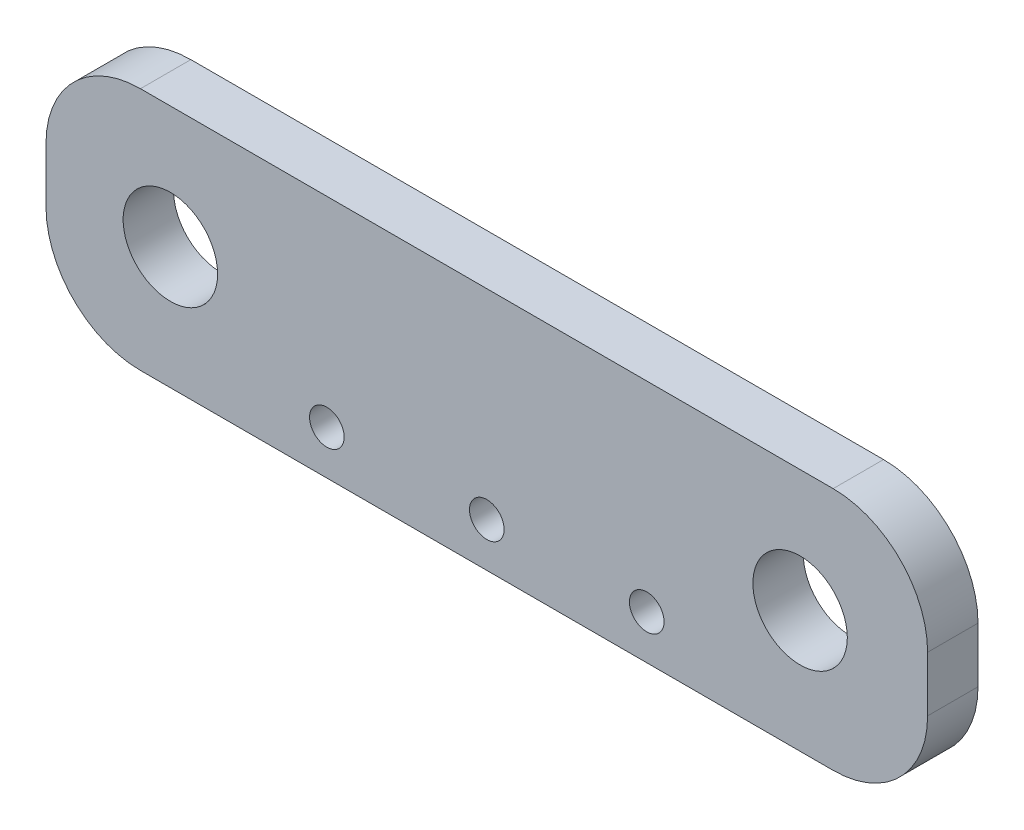
ISO-10303-21;
HEADER;
FILE_DESCRIPTION(('STEP AP214'),'2;1');
FILE_NAME('part.step','',(''),(''),'','','');
FILE_SCHEMA(('AUTOMOTIVE_DESIGN { 1 0 10303 214 1 1 1 1 }'));
ENDSEC;
DATA;
#1=APPLICATION_CONTEXT('core data for automotive mechanical design processes');
#2=APPLICATION_PROTOCOL_DEFINITION('international standard','automotive_design',2000,#1);
#3=PRODUCT_CONTEXT('',#1,'mechanical');
#4=PRODUCT('Part','Part','',(#3));
#5=PRODUCT_RELATED_PRODUCT_CATEGORY('part','',(#4));
#6=PRODUCT_DEFINITION_FORMATION('','',#4);
#7=PRODUCT_DEFINITION_CONTEXT('part definition',#1,'design');
#8=PRODUCT_DEFINITION('design','',#6,#7);
#9=PRODUCT_DEFINITION_SHAPE('','',#8);
#10=(LENGTH_UNIT() NAMED_UNIT(*) SI_UNIT(.MILLI.,.METRE.));
#11=(NAMED_UNIT(*) PLANE_ANGLE_UNIT() SI_UNIT($,.RADIAN.));
#12=(NAMED_UNIT(*) SI_UNIT($,.STERADIAN.) SOLID_ANGLE_UNIT());
#13=UNCERTAINTY_MEASURE_WITH_UNIT(LENGTH_MEASURE(1.E-05),#10,'distance_accuracy_value','');
#14=(GEOMETRIC_REPRESENTATION_CONTEXT(3) GLOBAL_UNCERTAINTY_ASSIGNED_CONTEXT((#13)) GLOBAL_UNIT_ASSIGNED_CONTEXT((#10,
#11,#12)) REPRESENTATION_CONTEXT('',''));
#15=CARTESIAN_POINT('',(0.,0.,0.));
#16=DIRECTION('',(0.,0.,1.));
#17=DIRECTION('',(1.,0.,0.));
#18=AXIS2_PLACEMENT_3D('',#15,#16,#17);
#19=CARTESIAN_POINT('',(14.,-3.875,1.6));
#20=DIRECTION('',(-1.,0.,0.));
#21=DIRECTION('',(0.,0.,1.));
#22=AXIS2_PLACEMENT_3D('',#19,#20,#21);
#23=PLANE('',#22);
#24=DIRECTION('',(0.,1.,0.));
#25=VECTOR('',#24,1.);
#26=CARTESIAN_POINT('',(14.,-3.875,0.));
#27=LINE('',#26,#25);
#28=CARTESIAN_POINT('',(14.,-0.875,0.));
#29=VERTEX_POINT('',#28);
#30=CARTESIAN_POINT('',(14.,0.875,0.));
#31=VERTEX_POINT('',#30);
#32=EDGE_CURVE('E129',#29,#31,#27,.T.);
#33=ORIENTED_EDGE('',*,*,#32,.T.);
#34=DIRECTION('',(0.,0.,-1.));
#35=VECTOR('',#34,1.);
#36=CARTESIAN_POINT('',(14.,0.875,1.6));
#37=LINE('',#36,#35);
#38=CARTESIAN_POINT('',(14.,0.875,1.6));
#39=VERTEX_POINT('',#38);
#40=EDGE_CURVE('E106',#31,#39,#37,.F.);
#41=ORIENTED_EDGE('',*,*,#40,.T.);
#42=DIRECTION('',(0.,1.,0.));
#43=VECTOR('',#42,1.);
#44=CARTESIAN_POINT('',(14.,-3.875,1.6));
#45=LINE('',#44,#43);
#46=CARTESIAN_POINT('',(14.,-0.875,1.6));
#47=VERTEX_POINT('',#46);
#48=EDGE_CURVE('E139',#47,#39,#45,.T.);
#49=ORIENTED_EDGE('',*,*,#48,.F.);
#50=DIRECTION('',(0.,0.,-1.));
#51=VECTOR('',#50,1.);
#52=CARTESIAN_POINT('',(14.,-0.875,1.6));
#53=LINE('',#52,#51);
#54=EDGE_CURVE('E111',#47,#29,#53,.T.);
#55=ORIENTED_EDGE('',*,*,#54,.T.);
#56=EDGE_LOOP('',(#33,#41,#49,#55));
#57=FACE_BOUND('',#56,.T.);
#58=ADVANCED_FACE('F34',(#57),#23,.F.);
#59=CARTESIAN_POINT('',(-14.,3.875,1.6));
#60=DIRECTION('',(0.,-1.,0.));
#61=DIRECTION('',(0.,0.,-1.));
#62=AXIS2_PLACEMENT_3D('',#59,#60,#61);
#63=PLANE('',#62);
#64=DIRECTION('',(-1.,0.,0.));
#65=VECTOR('',#64,1.);
#66=CARTESIAN_POINT('',(-14.,3.875,1.6));
#67=LINE('',#66,#65);
#68=CARTESIAN_POINT('',(11.,3.875,1.6));
#69=VERTEX_POINT('',#68);
#70=CARTESIAN_POINT('',(-11.,3.875,1.6));
#71=VERTEX_POINT('',#70);
#72=EDGE_CURVE('E121',#69,#71,#67,.T.);
#73=ORIENTED_EDGE('',*,*,#72,.F.);
#74=DIRECTION('',(0.,0.,-1.));
#75=VECTOR('',#74,1.);
#76=CARTESIAN_POINT('',(11.,3.875,1.6));
#77=LINE('',#76,#75);
#78=CARTESIAN_POINT('',(11.,3.875,0.));
#79=VERTEX_POINT('',#78);
#80=EDGE_CURVE('E105',#69,#79,#77,.T.);
#81=ORIENTED_EDGE('',*,*,#80,.T.);
#82=DIRECTION('',(-1.,0.,0.));
#83=VECTOR('',#82,1.);
#84=CARTESIAN_POINT('',(-14.,3.875,0.));
#85=LINE('',#84,#83);
#86=CARTESIAN_POINT('',(-11.,3.875,0.));
#87=VERTEX_POINT('',#86);
#88=EDGE_CURVE('E118',#79,#87,#85,.T.);
#89=ORIENTED_EDGE('',*,*,#88,.T.);
#90=DIRECTION('',(0.,0.,-1.));
#91=VECTOR('',#90,1.);
#92=CARTESIAN_POINT('',(-11.,3.875,1.6));
#93=LINE('',#92,#91);
#94=EDGE_CURVE('E123',#87,#71,#93,.F.);
#95=ORIENTED_EDGE('',*,*,#94,.T.);
#96=EDGE_LOOP('',(#73,#81,#89,#95));
#97=FACE_BOUND('',#96,.T.);
#98=ADVANCED_FACE('F117',(#97),#63,.F.);
#99=CARTESIAN_POINT('',(-14.,-3.875,1.6));
#100=DIRECTION('',(1.,0.,0.));
#101=DIRECTION('',(0.,0.,-1.));
#102=AXIS2_PLACEMENT_3D('',#99,#100,#101);
#103=PLANE('',#102);
#104=DIRECTION('',(0.,-1.,0.));
#105=VECTOR('',#104,1.);
#106=CARTESIAN_POINT('',(-14.,-3.875,1.6));
#107=LINE('',#106,#105);
#108=CARTESIAN_POINT('',(-14.,0.875,1.6));
#109=VERTEX_POINT('',#108);
#110=CARTESIAN_POINT('',(-14.,-0.875,1.6));
#111=VERTEX_POINT('',#110);
#112=EDGE_CURVE('E162',#109,#111,#107,.T.);
#113=ORIENTED_EDGE('',*,*,#112,.F.);
#114=DIRECTION('',(0.,0.,-1.));
#115=VECTOR('',#114,1.);
#116=CARTESIAN_POINT('',(-14.,0.875,1.6));
#117=LINE('',#116,#115);
#118=CARTESIAN_POINT('',(-14.,0.875,0.));
#119=VERTEX_POINT('',#118);
#120=EDGE_CURVE('E11',#109,#119,#117,.T.);
#121=ORIENTED_EDGE('',*,*,#120,.T.);
#122=DIRECTION('',(0.,-1.,0.));
#123=VECTOR('',#122,1.);
#124=CARTESIAN_POINT('',(-14.,-3.875,0.));
#125=LINE('',#124,#123);
#126=CARTESIAN_POINT('',(-14.,-0.875,0.));
#127=VERTEX_POINT('',#126);
#128=EDGE_CURVE('E128',#119,#127,#125,.T.);
#129=ORIENTED_EDGE('',*,*,#128,.T.);
#130=DIRECTION('',(0.,0.,-1.));
#131=VECTOR('',#130,1.);
#132=CARTESIAN_POINT('',(-14.,-0.875,1.6));
#133=LINE('',#132,#131);
#134=EDGE_CURVE('E42',#127,#111,#133,.F.);
#135=ORIENTED_EDGE('',*,*,#134,.T.);
#136=EDGE_LOOP('',(#113,#121,#129,#135));
#137=FACE_BOUND('',#136,.T.);
#138=ADVANCED_FACE('F161',(#137),#103,.F.);
#139=CARTESIAN_POINT('',(-14.,-3.875,1.6));
#140=DIRECTION('',(0.,1.,0.));
#141=DIRECTION('',(0.,0.,1.));
#142=AXIS2_PLACEMENT_3D('',#139,#140,#141);
#143=PLANE('',#142);
#144=DIRECTION('',(1.,0.,0.));
#145=VECTOR('',#144,1.);
#146=CARTESIAN_POINT('',(-14.,-3.875,0.));
#147=LINE('',#146,#145);
#148=CARTESIAN_POINT('',(-11.,-3.875,0.));
#149=VERTEX_POINT('',#148);
#150=CARTESIAN_POINT('',(11.,-3.875,0.));
#151=VERTEX_POINT('',#150);
#152=EDGE_CURVE('E132',#149,#151,#147,.T.);
#153=ORIENTED_EDGE('',*,*,#152,.T.);
#154=DIRECTION('',(0.,0.,-1.));
#155=VECTOR('',#154,1.);
#156=CARTESIAN_POINT('',(11.,-3.875,1.6));
#157=LINE('',#156,#155);
#158=CARTESIAN_POINT('',(11.,-3.875,1.6));
#159=VERTEX_POINT('',#158);
#160=EDGE_CURVE('E49',#151,#159,#157,.F.);
#161=ORIENTED_EDGE('',*,*,#160,.T.);
#162=DIRECTION('',(1.,0.,0.));
#163=VECTOR('',#162,1.);
#164=CARTESIAN_POINT('',(-14.,-3.875,1.6));
#165=LINE('',#164,#163);
#166=CARTESIAN_POINT('',(-11.,-3.875,1.6));
#167=VERTEX_POINT('',#166);
#168=EDGE_CURVE('E140',#167,#159,#165,.T.);
#169=ORIENTED_EDGE('',*,*,#168,.F.);
#170=DIRECTION('',(0.,0.,-1.));
#171=VECTOR('',#170,1.);
#172=CARTESIAN_POINT('',(-11.,-3.875,1.6));
#173=LINE('',#172,#171);
#174=EDGE_CURVE('E155',#167,#149,#173,.T.);
#175=ORIENTED_EDGE('',*,*,#174,.T.);
#176=EDGE_LOOP('',(#153,#161,#169,#175));
#177=FACE_BOUND('',#176,.T.);
#178=ADVANCED_FACE('F171',(#177),#143,.F.);
#179=CARTESIAN_POINT('',(0.,0.,1.6));
#180=DIRECTION('',(0.,0.,-1.));
#181=DIRECTION('',(-1.,0.,0.));
#182=AXIS2_PLACEMENT_3D('',#179,#180,#181);
#183=PLANE('',#182);
#184=CARTESIAN_POINT('',(5.08,-2.475,1.6));
#185=DIRECTION('',(0.,0.,1.));
#186=DIRECTION('',(1.,0.,0.));
#187=AXIS2_PLACEMENT_3D('',#184,#185,#186);
#188=CIRCLE('',#187,0.55);
#189=CARTESIAN_POINT('',(5.63,-2.475,1.6));
#190=VERTEX_POINT('',#189);
#191=EDGE_CURVE('E205',#190,#190,#188,.T.);
#192=ORIENTED_EDGE('',*,*,#191,.F.);
#193=EDGE_LOOP('',(#192));
#194=FACE_BOUND('',#193,.T.);
#195=CARTESIAN_POINT('',(-5.08,-2.475,1.6));
#196=DIRECTION('',(0.,0.,1.));
#197=DIRECTION('',(1.,0.,0.));
#198=AXIS2_PLACEMENT_3D('',#195,#196,#197);
#199=CIRCLE('',#198,0.55);
#200=CARTESIAN_POINT('',(-4.53,-2.475,1.6));
#201=VERTEX_POINT('',#200);
#202=EDGE_CURVE('E199',#201,#201,#199,.T.);
#203=ORIENTED_EDGE('',*,*,#202,.F.);
#204=EDGE_LOOP('',(#203));
#205=FACE_BOUND('',#204,.T.);
#206=CARTESIAN_POINT('',(0.,-2.475,1.6));
#207=DIRECTION('',(0.,0.,1.));
#208=DIRECTION('',(1.,0.,0.));
#209=AXIS2_PLACEMENT_3D('',#206,#207,#208);
#210=CIRCLE('',#209,0.55);
#211=CARTESIAN_POINT('',(0.55,-2.475,1.6));
#212=VERTEX_POINT('',#211);
#213=EDGE_CURVE('E193',#212,#212,#210,.T.);
#214=ORIENTED_EDGE('',*,*,#213,.F.);
#215=EDGE_LOOP('',(#214));
#216=FACE_BOUND('',#215,.T.);
#217=CARTESIAN_POINT('',(9.9499999999999,0.,1.6));
#218=DIRECTION('',(0.,0.,1.));
#219=DIRECTION('',(1.,0.,0.));
#220=AXIS2_PLACEMENT_3D('',#217,#218,#219);
#221=CIRCLE('',#220,1.5);
#222=CARTESIAN_POINT('',(11.4499999999999,0.,1.6));
#223=VERTEX_POINT('',#222);
#224=EDGE_CURVE('E187',#223,#223,#221,.T.);
#225=ORIENTED_EDGE('',*,*,#224,.F.);
#226=EDGE_LOOP('',(#225));
#227=FACE_BOUND('',#226,.T.);
#228=CARTESIAN_POINT('',(-10.05,0.,1.6));
#229=DIRECTION('',(0.,0.,1.));
#230=DIRECTION('',(1.,0.,0.));
#231=AXIS2_PLACEMENT_3D('',#228,#229,#230);
#232=CIRCLE('',#231,1.5);
#233=CARTESIAN_POINT('',(-8.55,0.,1.6));
#234=VERTEX_POINT('',#233);
#235=EDGE_CURVE('E181',#234,#234,#232,.T.);
#236=ORIENTED_EDGE('',*,*,#235,.F.);
#237=EDGE_LOOP('',(#236));
#238=FACE_BOUND('',#237,.T.);
#239=ORIENTED_EDGE('',*,*,#48,.T.);
#240=CARTESIAN_POINT('',(11.,0.875,1.6));
#241=DIRECTION('',(0.,0.,-1.));
#242=DIRECTION('',(-1.,0.,0.));
#243=AXIS2_PLACEMENT_3D('',#240,#241,#242);
#244=CIRCLE('',#243,3.);
#245=EDGE_CURVE('E153',#39,#69,#244,.F.);
#246=ORIENTED_EDGE('',*,*,#245,.T.);
#247=ORIENTED_EDGE('',*,*,#72,.T.);
#248=CARTESIAN_POINT('',(-11.,0.875,1.6));
#249=DIRECTION('',(0.,0.,-1.));
#250=DIRECTION('',(-1.,0.,0.));
#251=AXIS2_PLACEMENT_3D('',#248,#249,#250);
#252=CIRCLE('',#251,3.);
#253=EDGE_CURVE('E149',#71,#109,#252,.F.);
#254=ORIENTED_EDGE('',*,*,#253,.T.);
#255=ORIENTED_EDGE('',*,*,#112,.T.);
#256=CARTESIAN_POINT('',(-11.,-0.875,1.6));
#257=DIRECTION('',(0.,0.,-1.));
#258=DIRECTION('',(-1.,0.,0.));
#259=AXIS2_PLACEMENT_3D('',#256,#257,#258);
#260=CIRCLE('',#259,3.);
#261=EDGE_CURVE('E56',#111,#167,#260,.F.);
#262=ORIENTED_EDGE('',*,*,#261,.T.);
#263=ORIENTED_EDGE('',*,*,#168,.T.);
#264=CARTESIAN_POINT('',(11.,-0.875,1.6));
#265=DIRECTION('',(0.,0.,-1.));
#266=DIRECTION('',(-1.,0.,0.));
#267=AXIS2_PLACEMENT_3D('',#264,#265,#266);
#268=CIRCLE('',#267,3.);
#269=EDGE_CURVE('E151',#159,#47,#268,.F.);
#270=ORIENTED_EDGE('',*,*,#269,.T.);
#271=EDGE_LOOP('',(#239,#246,#247,#254,#255,#262,#263,#270));
#272=FACE_BOUND('',#271,.T.);
#273=ADVANCED_FACE('F166',(#194,#205,#216,#227,#238,#272),#183,.F.);
#274=CARTESIAN_POINT('',(0.,0.,0.));
#275=DIRECTION('',(0.,0.,-1.));
#276=DIRECTION('',(-1.,0.,0.));
#277=AXIS2_PLACEMENT_3D('',#274,#275,#276);
#278=PLANE('',#277);
#279=CARTESIAN_POINT('',(5.08,-2.475,0.));
#280=DIRECTION('',(0.,0.,1.));
#281=DIRECTION('',(1.,0.,0.));
#282=AXIS2_PLACEMENT_3D('',#279,#280,#281);
#283=CIRCLE('',#282,0.55);
#284=CARTESIAN_POINT('',(5.63,-2.475,0.));
#285=VERTEX_POINT('',#284);
#286=EDGE_CURVE('E202',#285,#285,#283,.T.);
#287=ORIENTED_EDGE('',*,*,#286,.T.);
#288=EDGE_LOOP('',(#287));
#289=FACE_BOUND('',#288,.T.);
#290=CARTESIAN_POINT('',(-5.08,-2.475,0.));
#291=DIRECTION('',(0.,0.,1.));
#292=DIRECTION('',(1.,0.,0.));
#293=AXIS2_PLACEMENT_3D('',#290,#291,#292);
#294=CIRCLE('',#293,0.55);
#295=CARTESIAN_POINT('',(-4.53,-2.475,0.));
#296=VERTEX_POINT('',#295);
#297=EDGE_CURVE('E196',#296,#296,#294,.T.);
#298=ORIENTED_EDGE('',*,*,#297,.T.);
#299=EDGE_LOOP('',(#298));
#300=FACE_BOUND('',#299,.T.);
#301=CARTESIAN_POINT('',(0.,-2.475,0.));
#302=DIRECTION('',(0.,0.,1.));
#303=DIRECTION('',(1.,0.,0.));
#304=AXIS2_PLACEMENT_3D('',#301,#302,#303);
#305=CIRCLE('',#304,0.55);
#306=CARTESIAN_POINT('',(0.55,-2.475,0.));
#307=VERTEX_POINT('',#306);
#308=EDGE_CURVE('E190',#307,#307,#305,.T.);
#309=ORIENTED_EDGE('',*,*,#308,.T.);
#310=EDGE_LOOP('',(#309));
#311=FACE_BOUND('',#310,.T.);
#312=CARTESIAN_POINT('',(9.9499999999999,0.,0.));
#313=DIRECTION('',(0.,0.,1.));
#314=DIRECTION('',(1.,0.,0.));
#315=AXIS2_PLACEMENT_3D('',#312,#313,#314);
#316=CIRCLE('',#315,1.5);
#317=CARTESIAN_POINT('',(11.4499999999999,0.,0.));
#318=VERTEX_POINT('',#317);
#319=EDGE_CURVE('E184',#318,#318,#316,.T.);
#320=ORIENTED_EDGE('',*,*,#319,.T.);
#321=EDGE_LOOP('',(#320));
#322=FACE_BOUND('',#321,.T.);
#323=CARTESIAN_POINT('',(-10.05,0.,0.));
#324=DIRECTION('',(0.,0.,1.));
#325=DIRECTION('',(1.,0.,0.));
#326=AXIS2_PLACEMENT_3D('',#323,#324,#325);
#327=CIRCLE('',#326,1.5);
#328=CARTESIAN_POINT('',(-8.55,0.,0.));
#329=VERTEX_POINT('',#328);
#330=EDGE_CURVE('E134',#329,#329,#327,.T.);
#331=ORIENTED_EDGE('',*,*,#330,.T.);
#332=EDGE_LOOP('',(#331));
#333=FACE_BOUND('',#332,.T.);
#334=ORIENTED_EDGE('',*,*,#88,.F.);
#335=CARTESIAN_POINT('',(11.,0.875,0.));
#336=DIRECTION('',(0.,0.,-1.));
#337=DIRECTION('',(-1.,0.,0.));
#338=AXIS2_PLACEMENT_3D('',#335,#336,#337);
#339=CIRCLE('',#338,3.);
#340=EDGE_CURVE('E101',#79,#31,#339,.T.);
#341=ORIENTED_EDGE('',*,*,#340,.T.);
#342=ORIENTED_EDGE('',*,*,#32,.F.);
#343=CARTESIAN_POINT('',(11.,-0.875,0.));
#344=DIRECTION('',(0.,0.,-1.));
#345=DIRECTION('',(-1.,0.,0.));
#346=AXIS2_PLACEMENT_3D('',#343,#344,#345);
#347=CIRCLE('',#346,3.);
#348=EDGE_CURVE('E112',#29,#151,#347,.T.);
#349=ORIENTED_EDGE('',*,*,#348,.T.);
#350=ORIENTED_EDGE('',*,*,#152,.F.);
#351=CARTESIAN_POINT('',(-11.,-0.875,0.));
#352=DIRECTION('',(0.,0.,-1.));
#353=DIRECTION('',(-1.,0.,0.));
#354=AXIS2_PLACEMENT_3D('',#351,#352,#353);
#355=CIRCLE('',#354,3.);
#356=EDGE_CURVE('E122',#149,#127,#355,.T.);
#357=ORIENTED_EDGE('',*,*,#356,.T.);
#358=ORIENTED_EDGE('',*,*,#128,.F.);
#359=CARTESIAN_POINT('',(-11.,0.875,0.));
#360=DIRECTION('',(0.,0.,-1.));
#361=DIRECTION('',(-1.,0.,0.));
#362=AXIS2_PLACEMENT_3D('',#359,#360,#361);
#363=CIRCLE('',#362,3.);
#364=EDGE_CURVE('E127',#119,#87,#363,.T.);
#365=ORIENTED_EDGE('',*,*,#364,.T.);
#366=EDGE_LOOP('',(#334,#341,#342,#349,#350,#357,#358,#365));
#367=FACE_BOUND('',#366,.T.);
#368=ADVANCED_FACE('F125',(#289,#300,#311,#322,#333,#367),#278,.T.);
#369=CARTESIAN_POINT('',(-10.05,0.,0.));
#370=DIRECTION('',(0.,0.,1.));
#371=DIRECTION('',(1.,0.,0.));
#372=AXIS2_PLACEMENT_3D('',#369,#370,#371);
#373=CYLINDRICAL_SURFACE('',#372,1.5);
#374=ORIENTED_EDGE('',*,*,#330,.F.);
#375=EDGE_LOOP('',(#374));
#376=FACE_BOUND('',#375,.T.);
#377=ORIENTED_EDGE('',*,*,#235,.T.);
#378=EDGE_LOOP('',(#377));
#379=FACE_BOUND('',#378,.T.);
#380=ADVANCED_FACE('F231',(#376,#379),#373,.F.);
#381=CARTESIAN_POINT('',(9.9499999999999,0.,0.));
#382=DIRECTION('',(0.,0.,1.));
#383=DIRECTION('',(1.,0.,0.));
#384=AXIS2_PLACEMENT_3D('',#381,#382,#383);
#385=CYLINDRICAL_SURFACE('',#384,1.5);
#386=ORIENTED_EDGE('',*,*,#319,.F.);
#387=EDGE_LOOP('',(#386));
#388=FACE_BOUND('',#387,.T.);
#389=ORIENTED_EDGE('',*,*,#224,.T.);
#390=EDGE_LOOP('',(#389));
#391=FACE_BOUND('',#390,.T.);
#392=ADVANCED_FACE('F233',(#388,#391),#385,.F.);
#393=CARTESIAN_POINT('',(0.,-2.475,0.));
#394=DIRECTION('',(0.,0.,1.));
#395=DIRECTION('',(1.,0.,0.));
#396=AXIS2_PLACEMENT_3D('',#393,#394,#395);
#397=CYLINDRICAL_SURFACE('',#396,0.55);
#398=ORIENTED_EDGE('',*,*,#308,.F.);
#399=EDGE_LOOP('',(#398));
#400=FACE_BOUND('',#399,.T.);
#401=ORIENTED_EDGE('',*,*,#213,.T.);
#402=EDGE_LOOP('',(#401));
#403=FACE_BOUND('',#402,.T.);
#404=ADVANCED_FACE('F240',(#400,#403),#397,.F.);
#405=CARTESIAN_POINT('',(-5.08,-2.475,0.));
#406=DIRECTION('',(0.,0.,1.));
#407=DIRECTION('',(1.,0.,0.));
#408=AXIS2_PLACEMENT_3D('',#405,#406,#407);
#409=CYLINDRICAL_SURFACE('',#408,0.55);
#410=ORIENTED_EDGE('',*,*,#297,.F.);
#411=EDGE_LOOP('',(#410));
#412=FACE_BOUND('',#411,.T.);
#413=ORIENTED_EDGE('',*,*,#202,.T.);
#414=EDGE_LOOP('',(#413));
#415=FACE_BOUND('',#414,.T.);
#416=ADVANCED_FACE('F216',(#412,#415),#409,.F.);
#417=CARTESIAN_POINT('',(5.08,-2.475,0.));
#418=DIRECTION('',(0.,0.,1.));
#419=DIRECTION('',(1.,0.,0.));
#420=AXIS2_PLACEMENT_3D('',#417,#418,#419);
#421=CYLINDRICAL_SURFACE('',#420,0.55);
#422=ORIENTED_EDGE('',*,*,#286,.F.);
#423=EDGE_LOOP('',(#422));
#424=FACE_BOUND('',#423,.T.);
#425=ORIENTED_EDGE('',*,*,#191,.T.);
#426=EDGE_LOOP('',(#425));
#427=FACE_BOUND('',#426,.T.);
#428=ADVANCED_FACE('F213',(#424,#427),#421,.F.);
#429=CARTESIAN_POINT('',(11.,0.875,1.6));
#430=DIRECTION('',(0.,0.,-1.));
#431=DIRECTION('',(-1.,0.,0.));
#432=AXIS2_PLACEMENT_3D('',#429,#430,#431);
#433=CYLINDRICAL_SURFACE('',#432,3.);
#434=ORIENTED_EDGE('',*,*,#245,.F.);
#435=ORIENTED_EDGE('',*,*,#40,.F.);
#436=ORIENTED_EDGE('',*,*,#340,.F.);
#437=ORIENTED_EDGE('',*,*,#80,.F.);
#438=EDGE_LOOP('',(#434,#435,#436,#437));
#439=FACE_BOUND('',#438,.T.);
#440=ADVANCED_FACE('F104',(#439),#433,.T.);
#441=CARTESIAN_POINT('',(11.,-0.875,1.6));
#442=DIRECTION('',(0.,0.,-1.));
#443=DIRECTION('',(-1.,0.,0.));
#444=AXIS2_PLACEMENT_3D('',#441,#442,#443);
#445=CYLINDRICAL_SURFACE('',#444,3.);
#446=ORIENTED_EDGE('',*,*,#269,.F.);
#447=ORIENTED_EDGE('',*,*,#160,.F.);
#448=ORIENTED_EDGE('',*,*,#348,.F.);
#449=ORIENTED_EDGE('',*,*,#54,.F.);
#450=EDGE_LOOP('',(#446,#447,#448,#449));
#451=FACE_BOUND('',#450,.T.);
#452=ADVANCED_FACE('F175',(#451),#445,.T.);
#453=CARTESIAN_POINT('',(-11.,0.875,1.6));
#454=DIRECTION('',(0.,0.,-1.));
#455=DIRECTION('',(-1.,0.,0.));
#456=AXIS2_PLACEMENT_3D('',#453,#454,#455);
#457=CYLINDRICAL_SURFACE('',#456,3.);
#458=ORIENTED_EDGE('',*,*,#253,.F.);
#459=ORIENTED_EDGE('',*,*,#94,.F.);
#460=ORIENTED_EDGE('',*,*,#364,.F.);
#461=ORIENTED_EDGE('',*,*,#120,.F.);
#462=EDGE_LOOP('',(#458,#459,#460,#461));
#463=FACE_BOUND('',#462,.T.);
#464=ADVANCED_FACE('F256',(#463),#457,.T.);
#465=CARTESIAN_POINT('',(-11.,-0.875,1.6));
#466=DIRECTION('',(0.,0.,-1.));
#467=DIRECTION('',(-1.,0.,0.));
#468=AXIS2_PLACEMENT_3D('',#465,#466,#467);
#469=CYLINDRICAL_SURFACE('',#468,3.);
#470=ORIENTED_EDGE('',*,*,#261,.F.);
#471=ORIENTED_EDGE('',*,*,#134,.F.);
#472=ORIENTED_EDGE('',*,*,#356,.F.);
#473=ORIENTED_EDGE('',*,*,#174,.F.);
#474=EDGE_LOOP('',(#470,#471,#472,#473));
#475=FACE_BOUND('',#474,.T.);
#476=ADVANCED_FACE('F36',(#475),#469,.T.);
#477=CLOSED_SHELL('',(#58,#98,#138,#178,#273,#368,#380,#392,#404,#416,#428,#440,#452,#464,#476));
#478=MANIFOLD_SOLID_BREP('B2',#477);
#479=ADVANCED_BREP_SHAPE_REPRESENTATION('',(#18,#478),#14);
#480=SHAPE_DEFINITION_REPRESENTATION(#9,#479);
ENDSEC;
END-ISO-10303-21;
